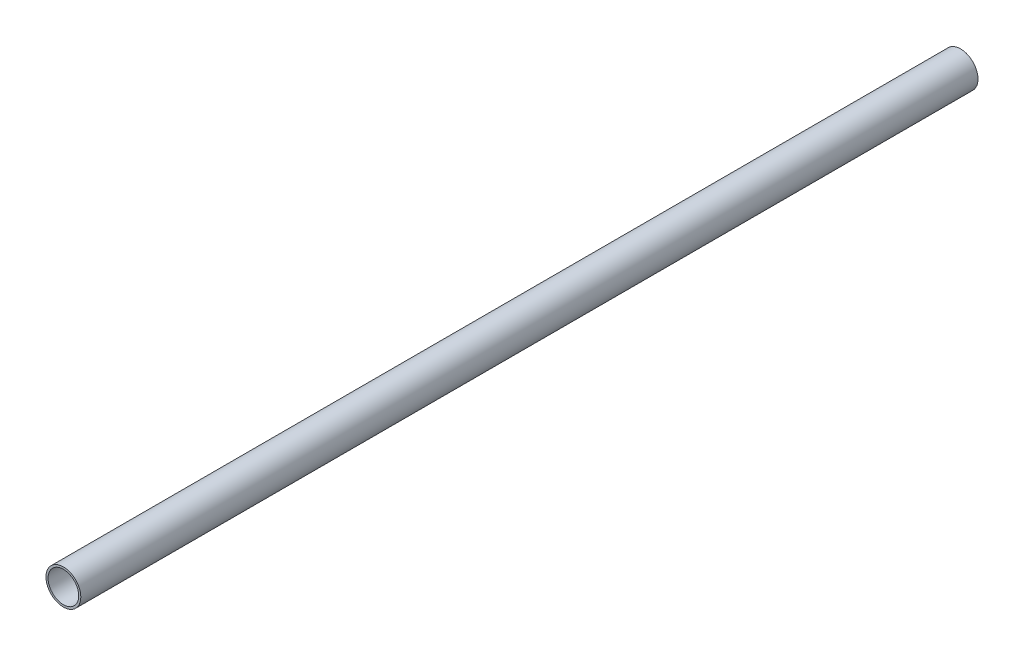
ISO-10303-21;
HEADER;
FILE_DESCRIPTION(('STEP AP214'),'2;1');
FILE_NAME('part.step','',(''),(''),'','','');
FILE_SCHEMA(('AUTOMOTIVE_DESIGN { 1 0 10303 214 1 1 1 1 }'));
ENDSEC;
DATA;
#1=APPLICATION_CONTEXT('core data for automotive mechanical design processes');
#2=APPLICATION_PROTOCOL_DEFINITION('international standard','automotive_design',2000,#1);
#3=PRODUCT_CONTEXT('',#1,'mechanical');
#4=PRODUCT('Part','Part','',(#3));
#5=PRODUCT_RELATED_PRODUCT_CATEGORY('part','',(#4));
#6=PRODUCT_DEFINITION_FORMATION('','',#4);
#7=PRODUCT_DEFINITION_CONTEXT('part definition',#1,'design');
#8=PRODUCT_DEFINITION('design','',#6,#7);
#9=PRODUCT_DEFINITION_SHAPE('','',#8);
#10=(LENGTH_UNIT() NAMED_UNIT(*) SI_UNIT(.MILLI.,.METRE.));
#11=(NAMED_UNIT(*) PLANE_ANGLE_UNIT() SI_UNIT($,.RADIAN.));
#12=(NAMED_UNIT(*) SI_UNIT($,.STERADIAN.) SOLID_ANGLE_UNIT());
#13=UNCERTAINTY_MEASURE_WITH_UNIT(LENGTH_MEASURE(1.E-05),#10,'distance_accuracy_value','');
#14=(GEOMETRIC_REPRESENTATION_CONTEXT(3) GLOBAL_UNCERTAINTY_ASSIGNED_CONTEXT((#13)) GLOBAL_UNIT_ASSIGNED_CONTEXT((#10,
#11,#12)) REPRESENTATION_CONTEXT('',''));
#15=CARTESIAN_POINT('',(0.,0.,0.));
#16=DIRECTION('',(0.,0.,1.));
#17=DIRECTION('',(1.,0.,0.));
#18=AXIS2_PLACEMENT_3D('',#15,#16,#17);
#19=CARTESIAN_POINT('',(0.,0.,644.));
#20=DIRECTION('',(0.,0.,1.));
#21=DIRECTION('',(1.,0.,0.));
#22=AXIS2_PLACEMENT_3D('',#19,#20,#21);
#23=PLANE('',#22);
#24=CARTESIAN_POINT('',(0.,0.,644.));
#25=DIRECTION('',(0.,0.,1.));
#26=DIRECTION('',(1.,0.,0.));
#27=AXIS2_PLACEMENT_3D('',#24,#25,#26);
#28=CIRCLE('',#27,12.5);
#29=CARTESIAN_POINT('',(12.5,0.,644.));
#30=VERTEX_POINT('',#29);
#31=EDGE_CURVE('E10',#30,#30,#28,.T.);
#32=ORIENTED_EDGE('',*,*,#31,.T.);
#33=EDGE_LOOP('',(#32));
#34=FACE_BOUND('',#33,.T.);
#35=CARTESIAN_POINT('',(0.,0.,644.));
#36=DIRECTION('',(0.,0.,1.));
#37=DIRECTION('',(1.,0.,0.));
#38=AXIS2_PLACEMENT_3D('',#35,#36,#37);
#39=CIRCLE('',#38,11.);
#40=CARTESIAN_POINT('',(11.,0.,644.));
#41=VERTEX_POINT('',#40);
#42=EDGE_CURVE('E42',#41,#41,#39,.T.);
#43=ORIENTED_EDGE('',*,*,#42,.F.);
#44=EDGE_LOOP('',(#43));
#45=FACE_BOUND('',#44,.T.);
#46=ADVANCED_FACE('F31',(#34,#45),#23,.T.);
#47=CARTESIAN_POINT('',(0.,0.,0.));
#48=DIRECTION('',(0.,0.,1.));
#49=DIRECTION('',(1.,0.,0.));
#50=AXIS2_PLACEMENT_3D('',#47,#48,#49);
#51=PLANE('',#50);
#52=CARTESIAN_POINT('',(0.,0.,0.));
#53=DIRECTION('',(0.,0.,1.));
#54=DIRECTION('',(1.,0.,0.));
#55=AXIS2_PLACEMENT_3D('',#52,#53,#54);
#56=CIRCLE('',#55,12.5);
#57=CARTESIAN_POINT('',(12.5,0.,0.));
#58=VERTEX_POINT('',#57);
#59=EDGE_CURVE('E35',#58,#58,#56,.T.);
#60=ORIENTED_EDGE('',*,*,#59,.F.);
#61=EDGE_LOOP('',(#60));
#62=FACE_BOUND('',#61,.T.);
#63=CARTESIAN_POINT('',(0.,0.,0.));
#64=DIRECTION('',(0.,0.,1.));
#65=DIRECTION('',(1.,0.,0.));
#66=AXIS2_PLACEMENT_3D('',#63,#64,#65);
#67=CIRCLE('',#66,11.);
#68=CARTESIAN_POINT('',(11.,0.,0.));
#69=VERTEX_POINT('',#68);
#70=EDGE_CURVE('E44',#69,#69,#67,.T.);
#71=ORIENTED_EDGE('',*,*,#70,.T.);
#72=EDGE_LOOP('',(#71));
#73=FACE_BOUND('',#72,.T.);
#74=ADVANCED_FACE('F54',(#62,#73),#51,.F.);
#75=CARTESIAN_POINT('',(0.,0.,644.));
#76=DIRECTION('',(0.,0.,-1.));
#77=DIRECTION('',(-1.,0.,0.));
#78=AXIS2_PLACEMENT_3D('',#75,#76,#77);
#79=CYLINDRICAL_SURFACE('',#78,12.5);
#80=ORIENTED_EDGE('',*,*,#31,.F.);
#81=EDGE_LOOP('',(#80));
#82=FACE_BOUND('',#81,.T.);
#83=ORIENTED_EDGE('',*,*,#59,.T.);
#84=EDGE_LOOP('',(#83));
#85=FACE_BOUND('',#84,.T.);
#86=ADVANCED_FACE('F33',(#82,#85),#79,.T.);
#87=CARTESIAN_POINT('',(0.,0.,644.));
#88=DIRECTION('',(0.,0.,-1.));
#89=DIRECTION('',(-1.,0.,0.));
#90=AXIS2_PLACEMENT_3D('',#87,#88,#89);
#91=CYLINDRICAL_SURFACE('',#90,11.);
#92=ORIENTED_EDGE('',*,*,#42,.T.);
#93=EDGE_LOOP('',(#92));
#94=FACE_BOUND('',#93,.T.);
#95=ORIENTED_EDGE('',*,*,#70,.F.);
#96=EDGE_LOOP('',(#95));
#97=FACE_BOUND('',#96,.T.);
#98=ADVANCED_FACE('F50',(#94,#97),#91,.F.);
#99=CLOSED_SHELL('',(#46,#74,#86,#98));
#100=MANIFOLD_SOLID_BREP('B2',#99);
#101=ADVANCED_BREP_SHAPE_REPRESENTATION('',(#18,#100),#14);
#102=SHAPE_DEFINITION_REPRESENTATION(#9,#101);
ENDSEC;
END-ISO-10303-21;
